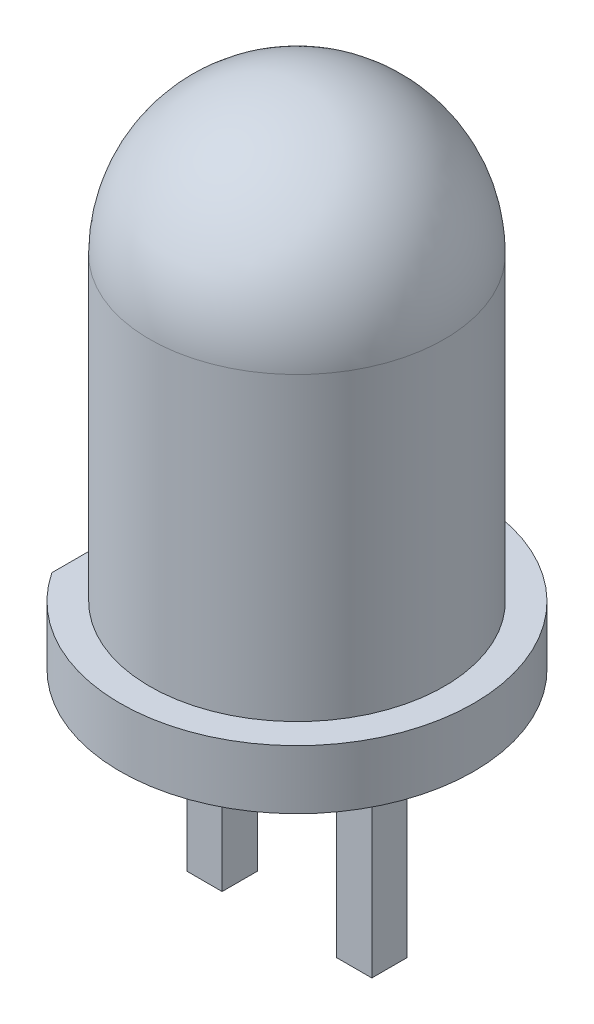
ISO-10303-21;
HEADER;
FILE_DESCRIPTION(('STEP AP214'),'2;1');
FILE_NAME('part.step','',(''),(''),'','','');
FILE_SCHEMA(('AUTOMOTIVE_DESIGN { 1 0 10303 214 1 1 1 1 }'));
ENDSEC;
DATA;
#1=APPLICATION_CONTEXT('core data for automotive mechanical design processes');
#2=APPLICATION_PROTOCOL_DEFINITION('international standard','automotive_design',2000,#1);
#3=PRODUCT_CONTEXT('',#1,'mechanical');
#4=PRODUCT('Part','Part','',(#3));
#5=PRODUCT_RELATED_PRODUCT_CATEGORY('part','',(#4));
#6=PRODUCT_DEFINITION_FORMATION('','',#4);
#7=PRODUCT_DEFINITION_CONTEXT('part definition',#1,'design');
#8=PRODUCT_DEFINITION('design','',#6,#7);
#9=PRODUCT_DEFINITION_SHAPE('','',#8);
#10=(LENGTH_UNIT() NAMED_UNIT(*) SI_UNIT(.MILLI.,.METRE.));
#11=(NAMED_UNIT(*) PLANE_ANGLE_UNIT() SI_UNIT($,.RADIAN.));
#12=(NAMED_UNIT(*) SI_UNIT($,.STERADIAN.) SOLID_ANGLE_UNIT());
#13=UNCERTAINTY_MEASURE_WITH_UNIT(LENGTH_MEASURE(1.E-05),#10,'distance_accuracy_value','');
#14=(GEOMETRIC_REPRESENTATION_CONTEXT(3) GLOBAL_UNCERTAINTY_ASSIGNED_CONTEXT((#13)) GLOBAL_UNIT_ASSIGNED_CONTEXT((#10,
#11,#12)) REPRESENTATION_CONTEXT('',''));
#15=CARTESIAN_POINT('',(0.,0.,0.));
#16=DIRECTION('',(0.,0.,1.));
#17=DIRECTION('',(1.,0.,0.));
#18=AXIS2_PLACEMENT_3D('',#15,#16,#17);
#19=CARTESIAN_POINT('',(0.,0.,0.));
#20=DIRECTION('',(0.,-1.,0.));
#21=DIRECTION('',(1.,0.,0.));
#22=AXIS2_PLACEMENT_3D('',#19,#20,#21);
#23=PLANE('',#22);
#24=DIRECTION('',(0.,0.,1.));
#25=VECTOR('',#24,1.);
#26=CARTESIAN_POINT('',(-2.5,0.,-2.));
#27=LINE('',#26,#25);
#28=CARTESIAN_POINT('',(-2.5,0.,-1.6583123951777));
#29=VERTEX_POINT('',#28);
#30=CARTESIAN_POINT('',(-2.5,0.,1.6583123951777));
#31=VERTEX_POINT('',#30);
#32=EDGE_CURVE('E119',#29,#31,#27,.T.);
#33=ORIENTED_EDGE('',*,*,#32,.F.);
#34=CARTESIAN_POINT('',(0.,0.,0.));
#35=DIRECTION('',(0.,1.,0.));
#36=DIRECTION('',(-1.,0.,0.));
#37=AXIS2_PLACEMENT_3D('',#34,#35,#36);
#38=CIRCLE('',#37,3.);
#39=EDGE_CURVE('E11',#31,#29,#38,.T.);
#40=ORIENTED_EDGE('',*,*,#39,.F.);
#41=EDGE_LOOP('',(#33,#40));
#42=FACE_BOUND('',#41,.T.);
#43=DIRECTION('',(-1.,0.,0.));
#44=VECTOR('',#43,1.);
#45=CARTESIAN_POINT('',(-1.57,0.,0.3));
#46=LINE('',#45,#44);
#47=CARTESIAN_POINT('',(-0.97,0.,0.3));
#48=VERTEX_POINT('',#47);
#49=CARTESIAN_POINT('',(-1.57,0.,0.3));
#50=VERTEX_POINT('',#49);
#51=EDGE_CURVE('E176',#48,#50,#46,.T.);
#52=ORIENTED_EDGE('',*,*,#51,.F.);
#53=DIRECTION('',(0.,0.,1.));
#54=VECTOR('',#53,1.);
#55=CARTESIAN_POINT('',(-0.97,0.,-0.3));
#56=LINE('',#55,#54);
#57=CARTESIAN_POINT('',(-0.97,0.,-0.3));
#58=VERTEX_POINT('',#57);
#59=EDGE_CURVE('E162',#58,#48,#56,.T.);
#60=ORIENTED_EDGE('',*,*,#59,.F.);
#61=DIRECTION('',(1.,0.,0.));
#62=VECTOR('',#61,1.);
#63=CARTESIAN_POINT('',(-1.57,0.,-0.3));
#64=LINE('',#63,#62);
#65=CARTESIAN_POINT('',(-1.57,0.,-0.3));
#66=VERTEX_POINT('',#65);
#67=EDGE_CURVE('E167',#66,#58,#64,.T.);
#68=ORIENTED_EDGE('',*,*,#67,.F.);
#69=DIRECTION('',(0.,0.,-1.));
#70=VECTOR('',#69,1.);
#71=CARTESIAN_POINT('',(-1.57,0.,-0.3));
#72=LINE('',#71,#70);
#73=EDGE_CURVE('E178',#50,#66,#72,.T.);
#74=ORIENTED_EDGE('',*,*,#73,.F.);
#75=EDGE_LOOP('',(#52,#60,#68,#74));
#76=FACE_BOUND('',#75,.T.);
#77=DIRECTION('',(-1.,0.,0.));
#78=VECTOR('',#77,1.);
#79=CARTESIAN_POINT('',(0.97,0.,0.3));
#80=LINE('',#79,#78);
#81=CARTESIAN_POINT('',(1.57,0.,0.3));
#82=VERTEX_POINT('',#81);
#83=CARTESIAN_POINT('',(0.97,0.,0.3));
#84=VERTEX_POINT('',#83);
#85=EDGE_CURVE('E135',#82,#84,#80,.T.);
#86=ORIENTED_EDGE('',*,*,#85,.F.);
#87=DIRECTION('',(0.,0.,1.));
#88=VECTOR('',#87,1.);
#89=CARTESIAN_POINT('',(1.57,0.,-0.3));
#90=LINE('',#89,#88);
#91=CARTESIAN_POINT('',(1.57,0.,-0.3));
#92=VERTEX_POINT('',#91);
#93=EDGE_CURVE('E132',#92,#82,#90,.T.);
#94=ORIENTED_EDGE('',*,*,#93,.F.);
#95=DIRECTION('',(1.,0.,0.));
#96=VECTOR('',#95,1.);
#97=CARTESIAN_POINT('',(0.97,0.,-0.3));
#98=LINE('',#97,#96);
#99=CARTESIAN_POINT('',(0.97,0.,-0.3));
#100=VERTEX_POINT('',#99);
#101=EDGE_CURVE('E143',#100,#92,#98,.T.);
#102=ORIENTED_EDGE('',*,*,#101,.F.);
#103=DIRECTION('',(0.,0.,-1.));
#104=VECTOR('',#103,1.);
#105=CARTESIAN_POINT('',(0.97,0.,-0.3));
#106=LINE('',#105,#104);
#107=EDGE_CURVE('E151',#84,#100,#106,.T.);
#108=ORIENTED_EDGE('',*,*,#107,.F.);
#109=EDGE_LOOP('',(#86,#94,#102,#108));
#110=FACE_BOUND('',#109,.T.);
#111=ADVANCED_FACE('F38',(#42,#76,#110),#23,.T.);
#112=CARTESIAN_POINT('',(0.,8.6,0.));
#113=DIRECTION('',(0.,1.,0.));
#114=DIRECTION('',(-1.,0.,0.));
#115=AXIS2_PLACEMENT_3D('',#112,#113,#114);
#116=CYLINDRICAL_SURFACE('',#115,3.);
#117=DIRECTION('',(0.,1.,0.));
#118=VECTOR('',#117,1.);
#119=CARTESIAN_POINT('',(-2.5,8.6,-1.6583123951777));
#120=LINE('',#119,#118);
#121=CARTESIAN_POINT('',(-2.5,0.999999999999999,-1.6583123951777));
#122=VERTEX_POINT('',#121);
#123=EDGE_CURVE('E116',#122,#29,#120,.F.);
#124=ORIENTED_EDGE('',*,*,#123,.F.);
#125=CARTESIAN_POINT('',(0.,0.999999999999999,0.));
#126=DIRECTION('',(0.,1.,0.));
#127=DIRECTION('',(-1.,0.,0.));
#128=AXIS2_PLACEMENT_3D('',#125,#126,#127);
#129=CIRCLE('',#128,3.);
#130=CARTESIAN_POINT('',(-2.5,0.999999999999999,1.6583123951777));
#131=VERTEX_POINT('',#130);
#132=EDGE_CURVE('E45',#131,#122,#129,.T.);
#133=ORIENTED_EDGE('',*,*,#132,.F.);
#134=DIRECTION('',(0.,1.,0.));
#135=VECTOR('',#134,1.);
#136=CARTESIAN_POINT('',(-2.5,8.6,1.6583123951777));
#137=LINE('',#136,#135);
#138=EDGE_CURVE('E131',#31,#131,#137,.T.);
#139=ORIENTED_EDGE('',*,*,#138,.F.);
#140=ORIENTED_EDGE('',*,*,#39,.T.);
#141=EDGE_LOOP('',(#124,#133,#139,#140));
#142=FACE_BOUND('',#141,.T.);
#143=ADVANCED_FACE('F130',(#142),#116,.T.);
#144=CARTESIAN_POINT('',(-3.,1.,0.));
#145=DIRECTION('',(0.,1.,0.));
#146=DIRECTION('',(-1.,0.,0.));
#147=AXIS2_PLACEMENT_3D('',#144,#145,#146);
#148=PLANE('',#147);
#149=DIRECTION('',(0.,0.,-1.));
#150=VECTOR('',#149,1.);
#151=CARTESIAN_POINT('',(-2.5,1.,0.));
#152=LINE('',#151,#150);
#153=CARTESIAN_POINT('',(-2.5,0.999999999999999,0.));
#154=VERTEX_POINT('',#153);
#155=EDGE_CURVE('E52',#131,#154,#152,.T.);
#156=ORIENTED_EDGE('',*,*,#155,.F.);
#157=ORIENTED_EDGE('',*,*,#132,.T.);
#158=EDGE_CURVE('E121',#154,#122,#152,.T.);
#159=ORIENTED_EDGE('',*,*,#158,.F.);
#160=CARTESIAN_POINT('',(0.,0.999999999999999,0.));
#161=DIRECTION('',(0.,1.,0.));
#162=DIRECTION('',(-1.,0.,0.));
#163=AXIS2_PLACEMENT_3D('',#160,#161,#162);
#164=CIRCLE('',#163,2.5);
#165=EDGE_CURVE('E194',#154,#154,#164,.T.);
#166=ORIENTED_EDGE('',*,*,#165,.F.);
#167=EDGE_LOOP('',(#156,#157,#159,#166));
#168=FACE_BOUND('',#167,.T.);
#169=ADVANCED_FACE('F197',(#168),#148,.T.);
#170=CARTESIAN_POINT('',(0.,8.6,0.));
#171=DIRECTION('',(0.,1.,0.));
#172=DIRECTION('',(-1.,0.,0.));
#173=AXIS2_PLACEMENT_3D('',#170,#171,#172);
#174=CYLINDRICAL_SURFACE('',#173,2.5);
#175=ORIENTED_EDGE('',*,*,#165,.T.);
#176=EDGE_LOOP('',(#175));
#177=FACE_BOUND('',#176,.T.);
#178=CARTESIAN_POINT('',(0.,6.1,0.));
#179=DIRECTION('',(0.,1.,0.));
#180=DIRECTION('',(-1.,0.,0.));
#181=AXIS2_PLACEMENT_3D('',#178,#179,#180);
#182=CIRCLE('',#181,2.5);
#183=CARTESIAN_POINT('',(-2.5,6.1,0.));
#184=VERTEX_POINT('',#183);
#185=EDGE_CURVE('E191',#184,#184,#182,.T.);
#186=ORIENTED_EDGE('',*,*,#185,.F.);
#187=EDGE_LOOP('',(#186));
#188=FACE_BOUND('',#187,.T.);
#189=ADVANCED_FACE('F200',(#177,#188),#174,.T.);
#190=CARTESIAN_POINT('',(0.,6.1,0.));
#191=DIRECTION('',(0.,1.,0.));
#192=DIRECTION('',(-1.,0.,0.));
#193=AXIS2_PLACEMENT_3D('',#190,#191,#192);
#194=SPHERICAL_SURFACE('',#193,2.5);
#195=ORIENTED_EDGE('',*,*,#185,.T.);
#196=EDGE_LOOP('',(#195));
#197=FACE_BOUND('',#196,.T.);
#198=ADVANCED_FACE('F203',(#197),#194,.T.);
#199=CARTESIAN_POINT('',(-0.97,-3.6,-0.3));
#200=DIRECTION('',(-1.,0.,0.));
#201=DIRECTION('',(0.,-1.,0.));
#202=AXIS2_PLACEMENT_3D('',#199,#200,#201);
#203=PLANE('',#202);
#204=ORIENTED_EDGE('',*,*,#59,.T.);
#205=DIRECTION('',(0.,1.,0.));
#206=VECTOR('',#205,1.);
#207=CARTESIAN_POINT('',(-0.97,-3.6,0.3));
#208=LINE('',#207,#206);
#209=CARTESIAN_POINT('',(-0.97,-3.6,0.3));
#210=VERTEX_POINT('',#209);
#211=EDGE_CURVE('E189',#210,#48,#208,.T.);
#212=ORIENTED_EDGE('',*,*,#211,.F.);
#213=DIRECTION('',(0.,0.,1.));
#214=VECTOR('',#213,1.);
#215=CARTESIAN_POINT('',(-0.97,-3.6,-0.3));
#216=LINE('',#215,#214);
#217=CARTESIAN_POINT('',(-0.97,-3.6,-0.3));
#218=VERTEX_POINT('',#217);
#219=EDGE_CURVE('E163',#218,#210,#216,.T.);
#220=ORIENTED_EDGE('',*,*,#219,.F.);
#221=DIRECTION('',(0.,1.,0.));
#222=VECTOR('',#221,1.);
#223=CARTESIAN_POINT('',(-0.97,-3.6,-0.3));
#224=LINE('',#223,#222);
#225=EDGE_CURVE('E173',#218,#58,#224,.T.);
#226=ORIENTED_EDGE('',*,*,#225,.T.);
#227=EDGE_LOOP('',(#204,#212,#220,#226));
#228=FACE_BOUND('',#227,.T.);
#229=ADVANCED_FACE('F208',(#228),#203,.F.);
#230=CARTESIAN_POINT('',(-1.57,-3.6,0.3));
#231=DIRECTION('',(0.,0.,-1.));
#232=DIRECTION('',(-1.,0.,0.));
#233=AXIS2_PLACEMENT_3D('',#230,#231,#232);
#234=PLANE('',#233);
#235=ORIENTED_EDGE('',*,*,#51,.T.);
#236=DIRECTION('',(0.,1.,0.));
#237=VECTOR('',#236,1.);
#238=CARTESIAN_POINT('',(-1.57,-3.6,0.3));
#239=LINE('',#238,#237);
#240=CARTESIAN_POINT('',(-1.57,-3.6,0.3));
#241=VERTEX_POINT('',#240);
#242=EDGE_CURVE('E186',#241,#50,#239,.T.);
#243=ORIENTED_EDGE('',*,*,#242,.F.);
#244=DIRECTION('',(-1.,0.,0.));
#245=VECTOR('',#244,1.);
#246=CARTESIAN_POINT('',(-1.57,-3.6,0.3));
#247=LINE('',#246,#245);
#248=EDGE_CURVE('E166',#210,#241,#247,.T.);
#249=ORIENTED_EDGE('',*,*,#248,.F.);
#250=ORIENTED_EDGE('',*,*,#211,.T.);
#251=EDGE_LOOP('',(#235,#243,#249,#250));
#252=FACE_BOUND('',#251,.T.);
#253=ADVANCED_FACE('F213',(#252),#234,.F.);
#254=CARTESIAN_POINT('',(-1.57,-3.6,-0.3));
#255=DIRECTION('',(1.,0.,0.));
#256=DIRECTION('',(0.,1.,0.));
#257=AXIS2_PLACEMENT_3D('',#254,#255,#256);
#258=PLANE('',#257);
#259=ORIENTED_EDGE('',*,*,#73,.T.);
#260=DIRECTION('',(0.,1.,0.));
#261=VECTOR('',#260,1.);
#262=CARTESIAN_POINT('',(-1.57,-3.6,-0.3));
#263=LINE('',#262,#261);
#264=CARTESIAN_POINT('',(-1.57,-3.6,-0.3));
#265=VERTEX_POINT('',#264);
#266=EDGE_CURVE('E184',#265,#66,#263,.T.);
#267=ORIENTED_EDGE('',*,*,#266,.F.);
#268=DIRECTION('',(0.,0.,-1.));
#269=VECTOR('',#268,1.);
#270=CARTESIAN_POINT('',(-1.57,-3.6,-0.3));
#271=LINE('',#270,#269);
#272=EDGE_CURVE('E169',#241,#265,#271,.T.);
#273=ORIENTED_EDGE('',*,*,#272,.F.);
#274=ORIENTED_EDGE('',*,*,#242,.T.);
#275=EDGE_LOOP('',(#259,#267,#273,#274));
#276=FACE_BOUND('',#275,.T.);
#277=ADVANCED_FACE('F319',(#276),#258,.F.);
#278=CARTESIAN_POINT('',(-1.57,-3.6,-0.3));
#279=DIRECTION('',(0.,0.,1.));
#280=DIRECTION('',(1.,0.,0.));
#281=AXIS2_PLACEMENT_3D('',#278,#279,#280);
#282=PLANE('',#281);
#283=ORIENTED_EDGE('',*,*,#67,.T.);
#284=ORIENTED_EDGE('',*,*,#225,.F.);
#285=DIRECTION('',(1.,0.,0.));
#286=VECTOR('',#285,1.);
#287=CARTESIAN_POINT('',(-1.57,-3.6,-0.3));
#288=LINE('',#287,#286);
#289=EDGE_CURVE('E171',#265,#218,#288,.T.);
#290=ORIENTED_EDGE('',*,*,#289,.F.);
#291=ORIENTED_EDGE('',*,*,#266,.T.);
#292=EDGE_LOOP('',(#283,#284,#290,#291));
#293=FACE_BOUND('',#292,.T.);
#294=ADVANCED_FACE('F311',(#293),#282,.F.);
#295=CARTESIAN_POINT('',(0.,-3.6,0.));
#296=DIRECTION('',(0.,1.,0.));
#297=DIRECTION('',(-1.,0.,0.));
#298=AXIS2_PLACEMENT_3D('',#295,#296,#297);
#299=PLANE('',#298);
#300=ORIENTED_EDGE('',*,*,#219,.T.);
#301=ORIENTED_EDGE('',*,*,#248,.T.);
#302=ORIENTED_EDGE('',*,*,#272,.T.);
#303=ORIENTED_EDGE('',*,*,#289,.T.);
#304=EDGE_LOOP('',(#300,#301,#302,#303));
#305=FACE_BOUND('',#304,.T.);
#306=ADVANCED_FACE('F303',(#305),#299,.F.);
#307=CARTESIAN_POINT('',(1.57,-3.6,-0.3));
#308=DIRECTION('',(-1.,0.,0.));
#309=DIRECTION('',(0.,-1.,0.));
#310=AXIS2_PLACEMENT_3D('',#307,#308,#309);
#311=PLANE('',#310);
#312=ORIENTED_EDGE('',*,*,#93,.T.);
#313=DIRECTION('',(0.,1.,0.));
#314=VECTOR('',#313,1.);
#315=CARTESIAN_POINT('',(1.57,-3.6,0.3));
#316=LINE('',#315,#314);
#317=CARTESIAN_POINT('',(1.57,-3.6,0.3));
#318=VERTEX_POINT('',#317);
#319=EDGE_CURVE('E160',#318,#82,#316,.T.);
#320=ORIENTED_EDGE('',*,*,#319,.F.);
#321=DIRECTION('',(0.,0.,1.));
#322=VECTOR('',#321,1.);
#323=CARTESIAN_POINT('',(1.57,-3.6,-0.3));
#324=LINE('',#323,#322);
#325=CARTESIAN_POINT('',(1.57,-3.6,-0.3));
#326=VERTEX_POINT('',#325);
#327=EDGE_CURVE('E139',#326,#318,#324,.T.);
#328=ORIENTED_EDGE('',*,*,#327,.F.);
#329=DIRECTION('',(0.,1.,0.));
#330=VECTOR('',#329,1.);
#331=CARTESIAN_POINT('',(1.57,-3.6,-0.3));
#332=LINE('',#331,#330);
#333=EDGE_CURVE('E148',#326,#92,#332,.T.);
#334=ORIENTED_EDGE('',*,*,#333,.T.);
#335=EDGE_LOOP('',(#312,#320,#328,#334));
#336=FACE_BOUND('',#335,.T.);
#337=ADVANCED_FACE('F295',(#336),#311,.F.);
#338=CARTESIAN_POINT('',(0.97,-3.6,0.3));
#339=DIRECTION('',(0.,0.,-1.));
#340=DIRECTION('',(-1.,0.,0.));
#341=AXIS2_PLACEMENT_3D('',#338,#339,#340);
#342=PLANE('',#341);
#343=ORIENTED_EDGE('',*,*,#85,.T.);
#344=DIRECTION('',(0.,1.,0.));
#345=VECTOR('',#344,1.);
#346=CARTESIAN_POINT('',(0.97,-3.6,0.3));
#347=LINE('',#346,#345);
#348=CARTESIAN_POINT('',(0.97,-3.6,0.3));
#349=VERTEX_POINT('',#348);
#350=EDGE_CURVE('E157',#349,#84,#347,.T.);
#351=ORIENTED_EDGE('',*,*,#350,.F.);
#352=DIRECTION('',(-1.,0.,0.));
#353=VECTOR('',#352,1.);
#354=CARTESIAN_POINT('',(0.97,-3.6,0.3));
#355=LINE('',#354,#353);
#356=EDGE_CURVE('E142',#318,#349,#355,.T.);
#357=ORIENTED_EDGE('',*,*,#356,.F.);
#358=ORIENTED_EDGE('',*,*,#319,.T.);
#359=EDGE_LOOP('',(#343,#351,#357,#358));
#360=FACE_BOUND('',#359,.T.);
#361=ADVANCED_FACE('F287',(#360),#342,.F.);
#362=CARTESIAN_POINT('',(0.97,-3.6,-0.3));
#363=DIRECTION('',(1.,0.,0.));
#364=DIRECTION('',(0.,1.,0.));
#365=AXIS2_PLACEMENT_3D('',#362,#363,#364);
#366=PLANE('',#365);
#367=ORIENTED_EDGE('',*,*,#107,.T.);
#368=DIRECTION('',(0.,1.,0.));
#369=VECTOR('',#368,1.);
#370=CARTESIAN_POINT('',(0.97,-3.6,-0.3));
#371=LINE('',#370,#369);
#372=CARTESIAN_POINT('',(0.97,-3.6,-0.3));
#373=VERTEX_POINT('',#372);
#374=EDGE_CURVE('E60',#373,#100,#371,.T.);
#375=ORIENTED_EDGE('',*,*,#374,.F.);
#376=DIRECTION('',(0.,0.,-1.));
#377=VECTOR('',#376,1.);
#378=CARTESIAN_POINT('',(0.97,-3.6,-0.3));
#379=LINE('',#378,#377);
#380=EDGE_CURVE('E145',#349,#373,#379,.T.);
#381=ORIENTED_EDGE('',*,*,#380,.F.);
#382=ORIENTED_EDGE('',*,*,#350,.T.);
#383=EDGE_LOOP('',(#367,#375,#381,#382));
#384=FACE_BOUND('',#383,.T.);
#385=ADVANCED_FACE('F280',(#384),#366,.F.);
#386=CARTESIAN_POINT('',(0.97,-3.6,-0.3));
#387=DIRECTION('',(0.,0.,1.));
#388=DIRECTION('',(1.,0.,0.));
#389=AXIS2_PLACEMENT_3D('',#386,#387,#388);
#390=PLANE('',#389);
#391=ORIENTED_EDGE('',*,*,#101,.T.);
#392=ORIENTED_EDGE('',*,*,#333,.F.);
#393=DIRECTION('',(1.,0.,0.));
#394=VECTOR('',#393,1.);
#395=CARTESIAN_POINT('',(0.97,-3.6,-0.3));
#396=LINE('',#395,#394);
#397=EDGE_CURVE('E147',#373,#326,#396,.T.);
#398=ORIENTED_EDGE('',*,*,#397,.F.);
#399=ORIENTED_EDGE('',*,*,#374,.T.);
#400=EDGE_LOOP('',(#391,#392,#398,#399));
#401=FACE_BOUND('',#400,.T.);
#402=ADVANCED_FACE('F275',(#401),#390,.F.);
#403=CARTESIAN_POINT('',(0.,-3.6,0.));
#404=DIRECTION('',(0.,1.,0.));
#405=DIRECTION('',(-1.,0.,0.));
#406=AXIS2_PLACEMENT_3D('',#403,#404,#405);
#407=PLANE('',#406);
#408=ORIENTED_EDGE('',*,*,#327,.T.);
#409=ORIENTED_EDGE('',*,*,#356,.T.);
#410=ORIENTED_EDGE('',*,*,#380,.T.);
#411=ORIENTED_EDGE('',*,*,#397,.T.);
#412=EDGE_LOOP('',(#408,#409,#410,#411));
#413=FACE_BOUND('',#412,.T.);
#414=ADVANCED_FACE('F248',(#413),#407,.F.);
#415=CARTESIAN_POINT('',(-2.5,8.6,-2.));
#416=DIRECTION('',(1.,0.,0.));
#417=DIRECTION('',(0.,1.,0.));
#418=AXIS2_PLACEMENT_3D('',#415,#416,#417);
#419=PLANE('',#418);
#420=ORIENTED_EDGE('',*,*,#138,.T.);
#421=ORIENTED_EDGE('',*,*,#155,.T.);
#422=ORIENTED_EDGE('',*,*,#158,.T.);
#423=ORIENTED_EDGE('',*,*,#123,.T.);
#424=ORIENTED_EDGE('',*,*,#32,.T.);
#425=EDGE_LOOP('',(#420,#421,#422,#423,#424));
#426=FACE_BOUND('',#425,.T.);
#427=ADVANCED_FACE('F118',(#426),#419,.F.);
#428=CLOSED_SHELL('',(#111,#143,#169,#189,#198,#229,#253,#277,#294,#306,#337,#361,#385,#402,
#414,#427));
#429=MANIFOLD_SOLID_BREP('B2',#428);
#430=ADVANCED_BREP_SHAPE_REPRESENTATION('',(#18,#429),#14);
#431=SHAPE_DEFINITION_REPRESENTATION(#9,#430);
ENDSEC;
END-ISO-10303-21;
